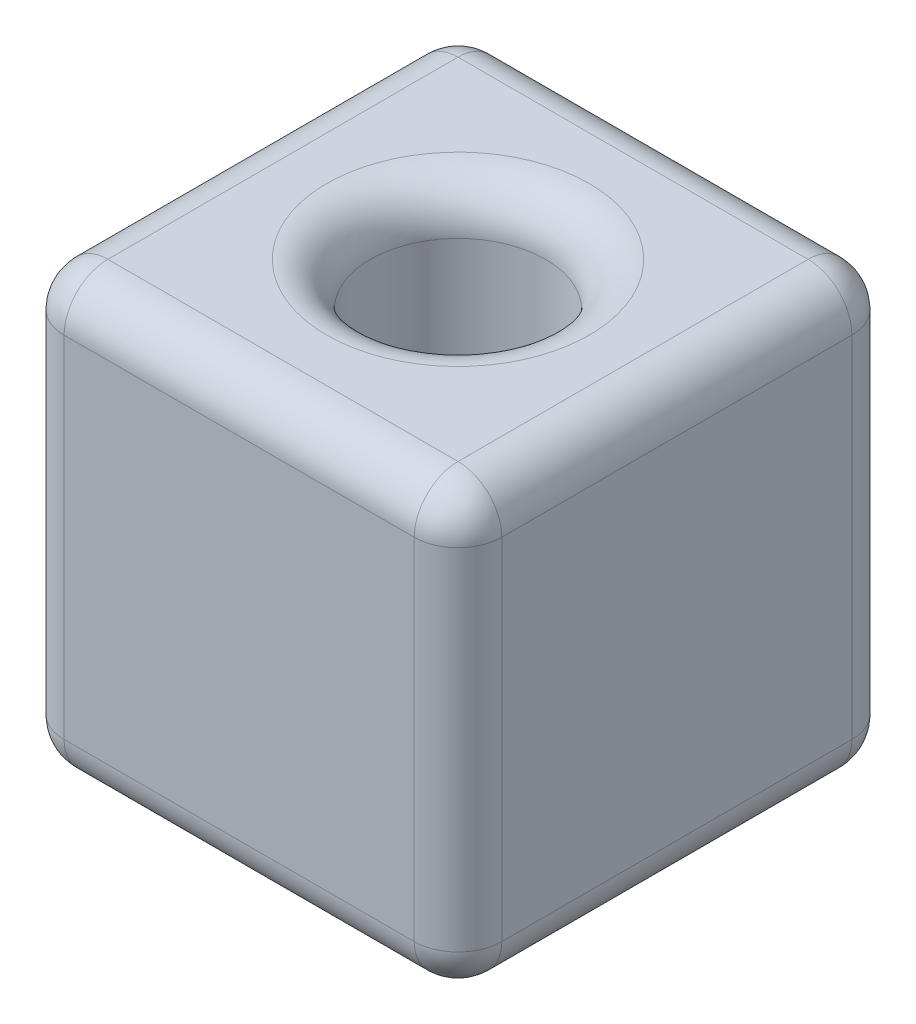
ISO-10303-21;
HEADER;
FILE_DESCRIPTION(('STEP AP214'),'2;1');
FILE_NAME('part.step','',(''),(''),'','','');
FILE_SCHEMA(('AUTOMOTIVE_DESIGN { 1 0 10303 214 1 1 1 1 }'));
ENDSEC;
DATA;
#1=APPLICATION_CONTEXT('core data for automotive mechanical design processes');
#2=APPLICATION_PROTOCOL_DEFINITION('international standard','automotive_design',2000,#1);
#3=PRODUCT_CONTEXT('',#1,'mechanical');
#4=PRODUCT('Part','Part','',(#3));
#5=PRODUCT_RELATED_PRODUCT_CATEGORY('part','',(#4));
#6=PRODUCT_DEFINITION_FORMATION('','',#4);
#7=PRODUCT_DEFINITION_CONTEXT('part definition',#1,'design');
#8=PRODUCT_DEFINITION('design','',#6,#7);
#9=PRODUCT_DEFINITION_SHAPE('','',#8);
#10=(LENGTH_UNIT() NAMED_UNIT(*) SI_UNIT(.MILLI.,.METRE.));
#11=(NAMED_UNIT(*) PLANE_ANGLE_UNIT() SI_UNIT($,.RADIAN.));
#12=(NAMED_UNIT(*) SI_UNIT($,.STERADIAN.) SOLID_ANGLE_UNIT());
#13=UNCERTAINTY_MEASURE_WITH_UNIT(LENGTH_MEASURE(1.E-05),#10,'distance_accuracy_value','');
#14=(GEOMETRIC_REPRESENTATION_CONTEXT(3) GLOBAL_UNCERTAINTY_ASSIGNED_CONTEXT((#13)) GLOBAL_UNIT_ASSIGNED_CONTEXT((#10,
#11,#12)) REPRESENTATION_CONTEXT('',''));
#15=CARTESIAN_POINT('',(0.,0.,0.));
#16=DIRECTION('',(0.,0.,1.));
#17=DIRECTION('',(1.,0.,0.));
#18=AXIS2_PLACEMENT_3D('',#15,#16,#17);
#19=CARTESIAN_POINT('',(2.5,2.5,-2.5));
#20=DIRECTION('',(-1.,0.,0.));
#21=DIRECTION('',(0.,0.,1.));
#22=AXIS2_PLACEMENT_3D('',#19,#20,#21);
#23=PLANE('',#22);
#24=DIRECTION('',(0.,0.,-1.));
#25=VECTOR('',#24,1.);
#26=CARTESIAN_POINT('',(2.5,-2.,-2.5));
#27=LINE('',#26,#25);
#28=CARTESIAN_POINT('',(2.5,-2.,2.));
#29=VERTEX_POINT('',#28);
#30=CARTESIAN_POINT('',(2.5,-2.,-2.));
#31=VERTEX_POINT('',#30);
#32=EDGE_CURVE('E138',#29,#31,#27,.T.);
#33=ORIENTED_EDGE('',*,*,#32,.T.);
#34=DIRECTION('',(0.,-1.,0.));
#35=VECTOR('',#34,1.);
#36=CARTESIAN_POINT('',(2.5,2.5,-2.));
#37=LINE('',#36,#35);
#38=CARTESIAN_POINT('',(2.5,2.,-2.));
#39=VERTEX_POINT('',#38);
#40=EDGE_CURVE('E195',#31,#39,#37,.F.);
#41=ORIENTED_EDGE('',*,*,#40,.T.);
#42=DIRECTION('',(0.,0.,-1.));
#43=VECTOR('',#42,1.);
#44=CARTESIAN_POINT('',(2.5,2.,2.5));
#45=LINE('',#44,#43);
#46=CARTESIAN_POINT('',(2.5,2.,2.));
#47=VERTEX_POINT('',#46);
#48=EDGE_CURVE('E190',#39,#47,#45,.F.);
#49=ORIENTED_EDGE('',*,*,#48,.T.);
#50=DIRECTION('',(0.,-1.,0.));
#51=VECTOR('',#50,1.);
#52=CARTESIAN_POINT('',(2.5,2.5,2.));
#53=LINE('',#52,#51);
#54=EDGE_CURVE('E192',#47,#29,#53,.T.);
#55=ORIENTED_EDGE('',*,*,#54,.T.);
#56=EDGE_LOOP('',(#33,#41,#49,#55));
#57=FACE_BOUND('',#56,.T.);
#58=ADVANCED_FACE('F33',(#57),#23,.F.);
#59=CARTESIAN_POINT('',(-2.5,2.5,-2.5));
#60=DIRECTION('',(0.,0.,1.));
#61=DIRECTION('',(1.,0.,0.));
#62=AXIS2_PLACEMENT_3D('',#59,#60,#61);
#63=PLANE('',#62);
#64=DIRECTION('',(-1.,0.,0.));
#65=VECTOR('',#64,1.);
#66=CARTESIAN_POINT('',(-2.5,-2.,-2.5));
#67=LINE('',#66,#65);
#68=CARTESIAN_POINT('',(2.,-2.,-2.5));
#69=VERTEX_POINT('',#68);
#70=CARTESIAN_POINT('',(-2.,-2.,-2.5));
#71=VERTEX_POINT('',#70);
#72=EDGE_CURVE('E185',#69,#71,#67,.T.);
#73=ORIENTED_EDGE('',*,*,#72,.T.);
#74=DIRECTION('',(0.,-1.,0.));
#75=VECTOR('',#74,1.);
#76=CARTESIAN_POINT('',(-2.,2.5,-2.5));
#77=LINE('',#76,#75);
#78=CARTESIAN_POINT('',(-2.,2.,-2.5));
#79=VERTEX_POINT('',#78);
#80=EDGE_CURVE('E187',#71,#79,#77,.F.);
#81=ORIENTED_EDGE('',*,*,#80,.T.);
#82=DIRECTION('',(-1.,0.,0.));
#83=VECTOR('',#82,1.);
#84=CARTESIAN_POINT('',(2.5,2.,-2.5));
#85=LINE('',#84,#83);
#86=CARTESIAN_POINT('',(2.,2.,-2.5));
#87=VERTEX_POINT('',#86);
#88=EDGE_CURVE('E181',#79,#87,#85,.F.);
#89=ORIENTED_EDGE('',*,*,#88,.T.);
#90=DIRECTION('',(0.,-1.,0.));
#91=VECTOR('',#90,1.);
#92=CARTESIAN_POINT('',(2.,2.5,-2.5));
#93=LINE('',#92,#91);
#94=EDGE_CURVE('E183',#87,#69,#93,.T.);
#95=ORIENTED_EDGE('',*,*,#94,.T.);
#96=EDGE_LOOP('',(#73,#81,#89,#95));
#97=FACE_BOUND('',#96,.T.);
#98=ADVANCED_FACE('F314',(#97),#63,.F.);
#99=CARTESIAN_POINT('',(-2.5,2.5,-2.5));
#100=DIRECTION('',(1.,0.,0.));
#101=DIRECTION('',(0.,0.,-1.));
#102=AXIS2_PLACEMENT_3D('',#99,#100,#101);
#103=PLANE('',#102);
#104=DIRECTION('',(0.,-1.,0.));
#105=VECTOR('',#104,1.);
#106=CARTESIAN_POINT('',(-2.5,2.5,-2.));
#107=LINE('',#106,#105);
#108=CARTESIAN_POINT('',(-2.5,2.,-2.));
#109=VERTEX_POINT('',#108);
#110=CARTESIAN_POINT('',(-2.5,-2.,-2.));
#111=VERTEX_POINT('',#110);
#112=EDGE_CURVE('E176',#109,#111,#107,.T.);
#113=ORIENTED_EDGE('',*,*,#112,.T.);
#114=DIRECTION('',(0.,0.,1.));
#115=VECTOR('',#114,1.);
#116=CARTESIAN_POINT('',(-2.5,-2.,-2.5));
#117=LINE('',#116,#115);
#118=CARTESIAN_POINT('',(-2.5,-2.,2.));
#119=VERTEX_POINT('',#118);
#120=EDGE_CURVE('E178',#111,#119,#117,.T.);
#121=ORIENTED_EDGE('',*,*,#120,.T.);
#122=DIRECTION('',(0.,-1.,0.));
#123=VECTOR('',#122,1.);
#124=CARTESIAN_POINT('',(-2.5,2.5,2.));
#125=LINE('',#124,#123);
#126=CARTESIAN_POINT('',(-2.5,2.,2.));
#127=VERTEX_POINT('',#126);
#128=EDGE_CURVE('E174',#119,#127,#125,.F.);
#129=ORIENTED_EDGE('',*,*,#128,.T.);
#130=DIRECTION('',(0.,0.,1.));
#131=VECTOR('',#130,1.);
#132=CARTESIAN_POINT('',(-2.5,2.,-2.5));
#133=LINE('',#132,#131);
#134=EDGE_CURVE('E172',#127,#109,#133,.F.);
#135=ORIENTED_EDGE('',*,*,#134,.T.);
#136=EDGE_LOOP('',(#113,#121,#129,#135));
#137=FACE_BOUND('',#136,.T.);
#138=ADVANCED_FACE('F341',(#137),#103,.F.);
#139=CARTESIAN_POINT('',(-2.5,2.5,2.5));
#140=DIRECTION('',(0.,0.,-1.));
#141=DIRECTION('',(-1.,0.,0.));
#142=AXIS2_PLACEMENT_3D('',#139,#140,#141);
#143=PLANE('',#142);
#144=DIRECTION('',(0.,-1.,0.));
#145=VECTOR('',#144,1.);
#146=CARTESIAN_POINT('',(-2.,2.5,2.5));
#147=LINE('',#146,#145);
#148=CARTESIAN_POINT('',(-2.,2.,2.5));
#149=VERTEX_POINT('',#148);
#150=CARTESIAN_POINT('',(-2.,-2.,2.5));
#151=VERTEX_POINT('',#150);
#152=EDGE_CURVE('E202',#149,#151,#147,.T.);
#153=ORIENTED_EDGE('',*,*,#152,.T.);
#154=DIRECTION('',(1.,0.,0.));
#155=VECTOR('',#154,1.);
#156=CARTESIAN_POINT('',(-2.5,-2.,2.5));
#157=LINE('',#156,#155);
#158=CARTESIAN_POINT('',(2.,-2.,2.5));
#159=VERTEX_POINT('',#158);
#160=EDGE_CURVE('E205',#151,#159,#157,.T.);
#161=ORIENTED_EDGE('',*,*,#160,.T.);
#162=DIRECTION('',(0.,-1.,0.));
#163=VECTOR('',#162,1.);
#164=CARTESIAN_POINT('',(2.,2.5,2.5));
#165=LINE('',#164,#163);
#166=CARTESIAN_POINT('',(2.,2.,2.5));
#167=VERTEX_POINT('',#166);
#168=EDGE_CURVE('E200',#159,#167,#165,.F.);
#169=ORIENTED_EDGE('',*,*,#168,.T.);
#170=DIRECTION('',(1.,0.,0.));
#171=VECTOR('',#170,1.);
#172=CARTESIAN_POINT('',(-2.5,2.,2.5));
#173=LINE('',#172,#171);
#174=EDGE_CURVE('E198',#167,#149,#173,.F.);
#175=ORIENTED_EDGE('',*,*,#174,.T.);
#176=EDGE_LOOP('',(#153,#161,#169,#175));
#177=FACE_BOUND('',#176,.T.);
#178=ADVANCED_FACE('F294',(#177),#143,.F.);
#179=CARTESIAN_POINT('',(0.,2.5,0.));
#180=DIRECTION('',(0.,1.,0.));
#181=DIRECTION('',(0.,0.,1.));
#182=AXIS2_PLACEMENT_3D('',#179,#180,#181);
#183=PLANE('',#182);
#184=DIRECTION('',(0.,0.,1.));
#185=VECTOR('',#184,1.);
#186=CARTESIAN_POINT('',(-2.,2.5,2.5));
#187=LINE('',#186,#185);
#188=CARTESIAN_POINT('',(-2.,2.5,-2.));
#189=VERTEX_POINT('',#188);
#190=CARTESIAN_POINT('',(-2.,2.5,2.));
#191=VERTEX_POINT('',#190);
#192=EDGE_CURVE('E42',#189,#191,#187,.T.);
#193=ORIENTED_EDGE('',*,*,#192,.T.);
#194=DIRECTION('',(1.,0.,0.));
#195=VECTOR('',#194,1.);
#196=CARTESIAN_POINT('',(2.5,2.5,2.));
#197=LINE('',#196,#195);
#198=CARTESIAN_POINT('',(2.,2.5,2.));
#199=VERTEX_POINT('',#198);
#200=EDGE_CURVE('E11',#191,#199,#197,.T.);
#201=ORIENTED_EDGE('',*,*,#200,.T.);
#202=DIRECTION('',(0.,0.,-1.));
#203=VECTOR('',#202,1.);
#204=CARTESIAN_POINT('',(2.,2.5,-2.5));
#205=LINE('',#204,#203);
#206=CARTESIAN_POINT('',(2.,2.5,-2.));
#207=VERTEX_POINT('',#206);
#208=EDGE_CURVE('E210',#199,#207,#205,.T.);
#209=ORIENTED_EDGE('',*,*,#208,.T.);
#210=DIRECTION('',(-1.,0.,0.));
#211=VECTOR('',#210,1.);
#212=CARTESIAN_POINT('',(-2.5,2.5,-2.));
#213=LINE('',#212,#211);
#214=EDGE_CURVE('E53',#207,#189,#213,.T.);
#215=ORIENTED_EDGE('',*,*,#214,.T.);
#216=EDGE_LOOP('',(#193,#201,#209,#215));
#217=FACE_BOUND('',#216,.T.);
#218=CARTESIAN_POINT('',(0.,2.5,0.));
#219=DIRECTION('',(0.,1.,0.));
#220=DIRECTION('',(0.,0.,1.));
#221=AXIS2_PLACEMENT_3D('',#218,#219,#220);
#222=CIRCLE('',#221,1.5);
#223=CARTESIAN_POINT('',(0.,2.5,1.5));
#224=VERTEX_POINT('',#223);
#225=EDGE_CURVE('E207',#224,#224,#222,.F.);
#226=ORIENTED_EDGE('',*,*,#225,.T.);
#227=EDGE_LOOP('',(#226));
#228=FACE_BOUND('',#227,.T.);
#229=ADVANCED_FACE('F274',(#217,#228),#183,.T.);
#230=CARTESIAN_POINT('',(0.,-2.5,0.));
#231=DIRECTION('',(0.,1.,0.));
#232=DIRECTION('',(0.,0.,1.));
#233=AXIS2_PLACEMENT_3D('',#230,#231,#232);
#234=PLANE('',#233);
#235=CARTESIAN_POINT('',(0.,-2.5,0.));
#236=DIRECTION('',(0.,1.,0.));
#237=DIRECTION('',(0.,0.,1.));
#238=AXIS2_PLACEMENT_3D('',#235,#236,#237);
#239=CIRCLE('',#238,1.5);
#240=CARTESIAN_POINT('',(0.,-2.5,1.5));
#241=VERTEX_POINT('',#240);
#242=EDGE_CURVE('E163',#241,#241,#239,.T.);
#243=ORIENTED_EDGE('',*,*,#242,.T.);
#244=EDGE_LOOP('',(#243));
#245=FACE_BOUND('',#244,.T.);
#246=DIRECTION('',(1.,0.,0.));
#247=VECTOR('',#246,1.);
#248=CARTESIAN_POINT('',(0.,-2.5,2.));
#249=LINE('',#248,#247);
#250=CARTESIAN_POINT('',(2.,-2.5,2.));
#251=VERTEX_POINT('',#250);
#252=CARTESIAN_POINT('',(-2.,-2.5,2.));
#253=VERTEX_POINT('',#252);
#254=EDGE_CURVE('E125',#251,#253,#249,.F.);
#255=ORIENTED_EDGE('',*,*,#254,.T.);
#256=DIRECTION('',(0.,0.,1.));
#257=VECTOR('',#256,1.);
#258=CARTESIAN_POINT('',(-2.,-2.5,0.));
#259=LINE('',#258,#257);
#260=CARTESIAN_POINT('',(-2.,-2.5,-2.));
#261=VERTEX_POINT('',#260);
#262=EDGE_CURVE('E161',#253,#261,#259,.F.);
#263=ORIENTED_EDGE('',*,*,#262,.T.);
#264=DIRECTION('',(-1.,0.,0.));
#265=VECTOR('',#264,1.);
#266=CARTESIAN_POINT('',(0.,-2.5,-2.));
#267=LINE('',#266,#265);
#268=CARTESIAN_POINT('',(2.,-2.5,-2.));
#269=VERTEX_POINT('',#268);
#270=EDGE_CURVE('E128',#261,#269,#267,.F.);
#271=ORIENTED_EDGE('',*,*,#270,.T.);
#272=DIRECTION('',(0.,0.,-1.));
#273=VECTOR('',#272,1.);
#274=CARTESIAN_POINT('',(2.,-2.5,0.));
#275=LINE('',#274,#273);
#276=EDGE_CURVE('E120',#269,#251,#275,.F.);
#277=ORIENTED_EDGE('',*,*,#276,.T.);
#278=EDGE_LOOP('',(#255,#263,#271,#277));
#279=FACE_BOUND('',#278,.T.);
#280=ADVANCED_FACE('F122',(#245,#279),#234,.F.);
#281=CARTESIAN_POINT('',(0.,-2.5,0.));
#282=DIRECTION('',(0.,1.,0.));
#283=DIRECTION('',(0.,0.,1.));
#284=AXIS2_PLACEMENT_3D('',#281,#282,#283);
#285=CYLINDRICAL_SURFACE('',#284,1.);
#286=CARTESIAN_POINT('',(0.,-2.,0.));
#287=DIRECTION('',(0.,1.,0.));
#288=DIRECTION('',(0.,0.,1.));
#289=AXIS2_PLACEMENT_3D('',#286,#287,#288);
#290=CIRCLE('',#289,1.);
#291=CARTESIAN_POINT('',(0.,-2.,1.));
#292=VERTEX_POINT('',#291);
#293=EDGE_CURVE('E169',#292,#292,#290,.F.);
#294=ORIENTED_EDGE('',*,*,#293,.T.);
#295=EDGE_LOOP('',(#294));
#296=FACE_BOUND('',#295,.T.);
#297=CARTESIAN_POINT('',(0.,2.,0.));
#298=DIRECTION('',(0.,1.,0.));
#299=DIRECTION('',(0.,0.,1.));
#300=AXIS2_PLACEMENT_3D('',#297,#298,#299);
#301=CIRCLE('',#300,1.);
#302=CARTESIAN_POINT('',(0.,2.,1.));
#303=VERTEX_POINT('',#302);
#304=EDGE_CURVE('E166',#303,#303,#301,.T.);
#305=ORIENTED_EDGE('',*,*,#304,.T.);
#306=EDGE_LOOP('',(#305));
#307=FACE_BOUND('',#306,.T.);
#308=ADVANCED_FACE('F347',(#296,#307),#285,.F.);
#309=CARTESIAN_POINT('',(0.,-2.,0.));
#310=DIRECTION('',(0.,1.,0.));
#311=DIRECTION('',(0.,0.,1.));
#312=AXIS2_PLACEMENT_3D('',#309,#310,#311);
#313=TOROIDAL_SURFACE('',#312,1.5,0.5);
#314=ORIENTED_EDGE('',*,*,#293,.F.);
#315=EDGE_LOOP('',(#314));
#316=FACE_BOUND('',#315,.T.);
#317=ORIENTED_EDGE('',*,*,#242,.F.);
#318=EDGE_LOOP('',(#317));
#319=FACE_BOUND('',#318,.T.);
#320=ADVANCED_FACE('F335',(#316,#319),#313,.T.);
#321=CARTESIAN_POINT('',(2.,2.,0.));
#322=DIRECTION('',(0.,0.,1.));
#323=DIRECTION('',(1.,0.,0.));
#324=AXIS2_PLACEMENT_3D('',#321,#322,#323);
#325=CYLINDRICAL_SURFACE('',#324,0.5);
#326=CARTESIAN_POINT('',(2.,2.,-2.));
#327=DIRECTION('',(0.,0.,-1.));
#328=DIRECTION('',(-1.,0.,0.));
#329=AXIS2_PLACEMENT_3D('',#326,#327,#328);
#330=CIRCLE('',#329,0.5);
#331=EDGE_CURVE('E37',#207,#39,#330,.T.);
#332=ORIENTED_EDGE('',*,*,#331,.F.);
#333=ORIENTED_EDGE('',*,*,#208,.F.);
#334=CARTESIAN_POINT('',(2.,2.,2.));
#335=DIRECTION('',(0.,0.,1.));
#336=DIRECTION('',(0.,-1.,0.));
#337=AXIS2_PLACEMENT_3D('',#334,#335,#336);
#338=CIRCLE('',#337,0.5);
#339=EDGE_CURVE('E158',#47,#199,#338,.T.);
#340=ORIENTED_EDGE('',*,*,#339,.F.);
#341=ORIENTED_EDGE('',*,*,#48,.F.);
#342=EDGE_LOOP('',(#332,#333,#340,#341));
#343=FACE_BOUND('',#342,.T.);
#344=ADVANCED_FACE('F272',(#343),#325,.T.);
#345=CARTESIAN_POINT('',(2.,2.,-2.));
#346=DIRECTION('',(0.,0.,1.));
#347=DIRECTION('',(1.,0.,0.));
#348=AXIS2_PLACEMENT_3D('',#345,#346,#347);
#349=SPHERICAL_SURFACE('',#348,0.5);
#350=CARTESIAN_POINT('',(2.,2.,-2.));
#351=DIRECTION('',(1.,0.,0.));
#352=DIRECTION('',(0.,1.,0.));
#353=AXIS2_PLACEMENT_3D('',#350,#351,#352);
#354=CIRCLE('',#353,0.5);
#355=EDGE_CURVE('E256',#207,#87,#354,.F.);
#356=ORIENTED_EDGE('',*,*,#355,.F.);
#357=ORIENTED_EDGE('',*,*,#331,.T.);
#358=CARTESIAN_POINT('',(2.,2.,-2.));
#359=DIRECTION('',(0.,1.,0.));
#360=DIRECTION('',(0.,0.,1.));
#361=AXIS2_PLACEMENT_3D('',#358,#359,#360);
#362=CIRCLE('',#361,0.5);
#363=EDGE_CURVE('E259',#87,#39,#362,.F.);
#364=ORIENTED_EDGE('',*,*,#363,.F.);
#365=EDGE_LOOP('',(#356,#357,#364));
#366=FACE_BOUND('',#365,.T.);
#367=ADVANCED_FACE('F327',(#366),#349,.T.);
#368=CARTESIAN_POINT('',(2.,2.,2.));
#369=DIRECTION('',(0.,0.,1.));
#370=DIRECTION('',(1.,0.,0.));
#371=AXIS2_PLACEMENT_3D('',#368,#369,#370);
#372=SPHERICAL_SURFACE('',#371,0.5);
#373=CARTESIAN_POINT('',(2.,2.,2.));
#374=DIRECTION('',(0.,1.,0.));
#375=DIRECTION('',(0.,0.,1.));
#376=AXIS2_PLACEMENT_3D('',#373,#374,#375);
#377=CIRCLE('',#376,0.5);
#378=EDGE_CURVE('E251',#47,#167,#377,.F.);
#379=ORIENTED_EDGE('',*,*,#378,.F.);
#380=ORIENTED_EDGE('',*,*,#339,.T.);
#381=CARTESIAN_POINT('',(2.,2.,2.));
#382=DIRECTION('',(1.,0.,0.));
#383=DIRECTION('',(0.,0.,-1.));
#384=AXIS2_PLACEMENT_3D('',#381,#382,#383);
#385=CIRCLE('',#384,0.5);
#386=EDGE_CURVE('E254',#167,#199,#385,.F.);
#387=ORIENTED_EDGE('',*,*,#386,.F.);
#388=EDGE_LOOP('',(#379,#380,#387));
#389=FACE_BOUND('',#388,.T.);
#390=ADVANCED_FACE('F266',(#389),#372,.T.);
#391=CARTESIAN_POINT('',(2.,2.5,-2.));
#392=DIRECTION('',(0.,-1.,0.));
#393=DIRECTION('',(0.,0.,-1.));
#394=AXIS2_PLACEMENT_3D('',#391,#392,#393);
#395=CYLINDRICAL_SURFACE('',#394,0.5);
#396=ORIENTED_EDGE('',*,*,#363,.T.);
#397=ORIENTED_EDGE('',*,*,#40,.F.);
#398=CARTESIAN_POINT('',(2.,-2.,-2.));
#399=DIRECTION('',(0.,-1.,0.));
#400=DIRECTION('',(0.,0.,-1.));
#401=AXIS2_PLACEMENT_3D('',#398,#399,#400);
#402=CIRCLE('',#401,0.5);
#403=EDGE_CURVE('E246',#69,#31,#402,.T.);
#404=ORIENTED_EDGE('',*,*,#403,.F.);
#405=ORIENTED_EDGE('',*,*,#94,.F.);
#406=EDGE_LOOP('',(#396,#397,#404,#405));
#407=FACE_BOUND('',#406,.T.);
#408=ADVANCED_FACE('F302',(#407),#395,.T.);
#409=CARTESIAN_POINT('',(0.,2.,-2.));
#410=DIRECTION('',(1.,0.,0.));
#411=DIRECTION('',(0.,0.,-1.));
#412=AXIS2_PLACEMENT_3D('',#409,#410,#411);
#413=CYLINDRICAL_SURFACE('',#412,0.5);
#414=ORIENTED_EDGE('',*,*,#355,.T.);
#415=ORIENTED_EDGE('',*,*,#88,.F.);
#416=CARTESIAN_POINT('',(-2.,2.,-2.));
#417=DIRECTION('',(-1.,0.,0.));
#418=DIRECTION('',(0.,0.,1.));
#419=AXIS2_PLACEMENT_3D('',#416,#417,#418);
#420=CIRCLE('',#419,0.5);
#421=EDGE_CURVE('E243',#189,#79,#420,.T.);
#422=ORIENTED_EDGE('',*,*,#421,.F.);
#423=ORIENTED_EDGE('',*,*,#214,.F.);
#424=EDGE_LOOP('',(#414,#415,#422,#423));
#425=FACE_BOUND('',#424,.T.);
#426=ADVANCED_FACE('F325',(#425),#413,.T.);
#427=CARTESIAN_POINT('',(-2.,2.,0.));
#428=DIRECTION('',(0.,0.,-1.));
#429=DIRECTION('',(-1.,0.,0.));
#430=AXIS2_PLACEMENT_3D('',#427,#428,#429);
#431=CYLINDRICAL_SURFACE('',#430,0.5);
#432=CARTESIAN_POINT('',(-2.,2.,2.));
#433=DIRECTION('',(0.,0.,1.));
#434=DIRECTION('',(1.,0.,0.));
#435=AXIS2_PLACEMENT_3D('',#432,#433,#434);
#436=CIRCLE('',#435,0.5);
#437=EDGE_CURVE('E237',#191,#127,#436,.T.);
#438=ORIENTED_EDGE('',*,*,#437,.F.);
#439=ORIENTED_EDGE('',*,*,#192,.F.);
#440=CARTESIAN_POINT('',(-2.,2.,-2.));
#441=DIRECTION('',(0.,0.,-1.));
#442=DIRECTION('',(-1.,0.,0.));
#443=AXIS2_PLACEMENT_3D('',#440,#441,#442);
#444=CIRCLE('',#443,0.5);
#445=EDGE_CURVE('E240',#109,#189,#444,.T.);
#446=ORIENTED_EDGE('',*,*,#445,.F.);
#447=ORIENTED_EDGE('',*,*,#134,.F.);
#448=EDGE_LOOP('',(#438,#439,#446,#447));
#449=FACE_BOUND('',#448,.T.);
#450=ADVANCED_FACE('F283',(#449),#431,.T.);
#451=CARTESIAN_POINT('',(0.,2.,2.));
#452=DIRECTION('',(-1.,0.,0.));
#453=DIRECTION('',(0.,0.,1.));
#454=AXIS2_PLACEMENT_3D('',#451,#452,#453);
#455=CYLINDRICAL_SURFACE('',#454,0.5);
#456=ORIENTED_EDGE('',*,*,#386,.T.);
#457=ORIENTED_EDGE('',*,*,#200,.F.);
#458=CARTESIAN_POINT('',(-2.,2.,2.));
#459=DIRECTION('',(-1.,0.,0.));
#460=DIRECTION('',(0.,0.,1.));
#461=AXIS2_PLACEMENT_3D('',#458,#459,#460);
#462=CIRCLE('',#461,0.5);
#463=EDGE_CURVE('E234',#149,#191,#462,.T.);
#464=ORIENTED_EDGE('',*,*,#463,.F.);
#465=ORIENTED_EDGE('',*,*,#174,.F.);
#466=EDGE_LOOP('',(#456,#457,#464,#465));
#467=FACE_BOUND('',#466,.T.);
#468=ADVANCED_FACE('F279',(#467),#455,.T.);
#469=CARTESIAN_POINT('',(2.,2.5,2.));
#470=DIRECTION('',(0.,-1.,0.));
#471=DIRECTION('',(0.,0.,-1.));
#472=AXIS2_PLACEMENT_3D('',#469,#470,#471);
#473=CYLINDRICAL_SURFACE('',#472,0.5);
#474=ORIENTED_EDGE('',*,*,#378,.T.);
#475=ORIENTED_EDGE('',*,*,#168,.F.);
#476=CARTESIAN_POINT('',(2.,-2.,2.));
#477=DIRECTION('',(0.,-1.,0.));
#478=DIRECTION('',(0.,0.,-1.));
#479=AXIS2_PLACEMENT_3D('',#476,#477,#478);
#480=CIRCLE('',#479,0.5);
#481=EDGE_CURVE('E142',#29,#159,#480,.T.);
#482=ORIENTED_EDGE('',*,*,#481,.F.);
#483=ORIENTED_EDGE('',*,*,#54,.F.);
#484=EDGE_LOOP('',(#474,#475,#482,#483));
#485=FACE_BOUND('',#484,.T.);
#486=ADVANCED_FACE('F297',(#485),#473,.T.);
#487=CARTESIAN_POINT('',(2.,-2.,-2.5));
#488=DIRECTION('',(0.,0.,-1.));
#489=DIRECTION('',(-1.,0.,0.));
#490=AXIS2_PLACEMENT_3D('',#487,#488,#489);
#491=CYLINDRICAL_SURFACE('',#490,0.5);
#492=CARTESIAN_POINT('',(2.,-2.,-2.));
#493=DIRECTION('',(0.,0.,-1.));
#494=DIRECTION('',(-1.,0.,0.));
#495=AXIS2_PLACEMENT_3D('',#492,#493,#494);
#496=CIRCLE('',#495,0.5);
#497=EDGE_CURVE('E249',#31,#269,#496,.T.);
#498=ORIENTED_EDGE('',*,*,#497,.F.);
#499=ORIENTED_EDGE('',*,*,#32,.F.);
#500=CARTESIAN_POINT('',(2.,-2.,2.));
#501=DIRECTION('',(0.,0.,1.));
#502=DIRECTION('',(1.,0.,0.));
#503=AXIS2_PLACEMENT_3D('',#500,#501,#502);
#504=CIRCLE('',#503,0.5);
#505=EDGE_CURVE('E135',#251,#29,#504,.T.);
#506=ORIENTED_EDGE('',*,*,#505,.F.);
#507=ORIENTED_EDGE('',*,*,#276,.F.);
#508=EDGE_LOOP('',(#498,#499,#506,#507));
#509=FACE_BOUND('',#508,.T.);
#510=ADVANCED_FACE('F137',(#509),#491,.T.);
#511=CARTESIAN_POINT('',(2.,-2.,-2.));
#512=DIRECTION('',(0.,0.,1.));
#513=DIRECTION('',(1.,0.,0.));
#514=AXIS2_PLACEMENT_3D('',#511,#512,#513);
#515=SPHERICAL_SURFACE('',#514,0.5);
#516=ORIENTED_EDGE('',*,*,#403,.T.);
#517=ORIENTED_EDGE('',*,*,#497,.T.);
#518=CARTESIAN_POINT('',(2.,-2.,-2.));
#519=DIRECTION('',(1.,0.,0.));
#520=DIRECTION('',(0.,0.,-1.));
#521=AXIS2_PLACEMENT_3D('',#518,#519,#520);
#522=CIRCLE('',#521,0.5);
#523=EDGE_CURVE('E143',#69,#269,#522,.F.);
#524=ORIENTED_EDGE('',*,*,#523,.F.);
#525=EDGE_LOOP('',(#516,#517,#524));
#526=FACE_BOUND('',#525,.T.);
#527=ADVANCED_FACE('F307',(#526),#515,.T.);
#528=CARTESIAN_POINT('',(-2.,2.,-2.));
#529=DIRECTION('',(0.,0.,1.));
#530=DIRECTION('',(1.,0.,0.));
#531=AXIS2_PLACEMENT_3D('',#528,#529,#530);
#532=SPHERICAL_SURFACE('',#531,0.5);
#533=ORIENTED_EDGE('',*,*,#445,.T.);
#534=ORIENTED_EDGE('',*,*,#421,.T.);
#535=CARTESIAN_POINT('',(-2.,2.,-2.));
#536=DIRECTION('',(0.,1.,0.));
#537=DIRECTION('',(0.,0.,1.));
#538=AXIS2_PLACEMENT_3D('',#535,#536,#537);
#539=CIRCLE('',#538,0.5);
#540=EDGE_CURVE('E229',#109,#79,#539,.F.);
#541=ORIENTED_EDGE('',*,*,#540,.F.);
#542=EDGE_LOOP('',(#533,#534,#541));
#543=FACE_BOUND('',#542,.T.);
#544=ADVANCED_FACE('F323',(#543),#532,.T.);
#545=CARTESIAN_POINT('',(-2.,2.,2.));
#546=DIRECTION('',(0.,0.,1.));
#547=DIRECTION('',(1.,0.,0.));
#548=AXIS2_PLACEMENT_3D('',#545,#546,#547);
#549=SPHERICAL_SURFACE('',#548,0.5);
#550=ORIENTED_EDGE('',*,*,#463,.T.);
#551=ORIENTED_EDGE('',*,*,#437,.T.);
#552=CARTESIAN_POINT('',(-2.,2.,2.));
#553=DIRECTION('',(0.,1.,0.));
#554=DIRECTION('',(0.,0.,1.));
#555=AXIS2_PLACEMENT_3D('',#552,#553,#554);
#556=CIRCLE('',#555,0.5);
#557=EDGE_CURVE('E150',#149,#127,#556,.F.);
#558=ORIENTED_EDGE('',*,*,#557,.F.);
#559=EDGE_LOOP('',(#550,#551,#558));
#560=FACE_BOUND('',#559,.T.);
#561=ADVANCED_FACE('F287',(#560),#549,.T.);
#562=CARTESIAN_POINT('',(2.,-2.,2.));
#563=DIRECTION('',(0.,0.,1.));
#564=DIRECTION('',(1.,0.,0.));
#565=AXIS2_PLACEMENT_3D('',#562,#563,#564);
#566=SPHERICAL_SURFACE('',#565,0.5);
#567=ORIENTED_EDGE('',*,*,#505,.T.);
#568=ORIENTED_EDGE('',*,*,#481,.T.);
#569=CARTESIAN_POINT('',(2.,-2.,2.));
#570=DIRECTION('',(1.,0.,0.));
#571=DIRECTION('',(0.,0.,-1.));
#572=AXIS2_PLACEMENT_3D('',#569,#570,#571);
#573=CIRCLE('',#572,0.5);
#574=EDGE_CURVE('E146',#251,#159,#573,.F.);
#575=ORIENTED_EDGE('',*,*,#574,.F.);
#576=EDGE_LOOP('',(#567,#568,#575));
#577=FACE_BOUND('',#576,.T.);
#578=ADVANCED_FACE('F147',(#577),#566,.T.);
#579=CARTESIAN_POINT('',(-2.5,-2.,-2.));
#580=DIRECTION('',(-1.,0.,0.));
#581=DIRECTION('',(0.,0.,1.));
#582=AXIS2_PLACEMENT_3D('',#579,#580,#581);
#583=CYLINDRICAL_SURFACE('',#582,0.5);
#584=ORIENTED_EDGE('',*,*,#523,.T.);
#585=ORIENTED_EDGE('',*,*,#270,.F.);
#586=CARTESIAN_POINT('',(-2.,-2.,-2.));
#587=DIRECTION('',(-1.,0.,0.));
#588=DIRECTION('',(0.,0.,1.));
#589=AXIS2_PLACEMENT_3D('',#586,#587,#588);
#590=CIRCLE('',#589,0.5);
#591=EDGE_CURVE('E151',#71,#261,#590,.T.);
#592=ORIENTED_EDGE('',*,*,#591,.F.);
#593=ORIENTED_EDGE('',*,*,#72,.F.);
#594=EDGE_LOOP('',(#584,#585,#592,#593));
#595=FACE_BOUND('',#594,.T.);
#596=ADVANCED_FACE('F311',(#595),#583,.T.);
#597=CARTESIAN_POINT('',(-2.,2.5,-2.));
#598=DIRECTION('',(0.,-1.,0.));
#599=DIRECTION('',(0.,0.,-1.));
#600=AXIS2_PLACEMENT_3D('',#597,#598,#599);
#601=CYLINDRICAL_SURFACE('',#600,0.5);
#602=ORIENTED_EDGE('',*,*,#540,.T.);
#603=ORIENTED_EDGE('',*,*,#80,.F.);
#604=CARTESIAN_POINT('',(-2.,-2.,-2.));
#605=DIRECTION('',(0.,-1.,0.));
#606=DIRECTION('',(0.,0.,-1.));
#607=AXIS2_PLACEMENT_3D('',#604,#605,#606);
#608=CIRCLE('',#607,0.5);
#609=EDGE_CURVE('E222',#111,#71,#608,.T.);
#610=ORIENTED_EDGE('',*,*,#609,.F.);
#611=ORIENTED_EDGE('',*,*,#112,.F.);
#612=EDGE_LOOP('',(#602,#603,#610,#611));
#613=FACE_BOUND('',#612,.T.);
#614=ADVANCED_FACE('F317',(#613),#601,.T.);
#615=CARTESIAN_POINT('',(-2.,2.5,2.));
#616=DIRECTION('',(0.,-1.,0.));
#617=DIRECTION('',(0.,0.,-1.));
#618=AXIS2_PLACEMENT_3D('',#615,#616,#617);
#619=CYLINDRICAL_SURFACE('',#618,0.5);
#620=ORIENTED_EDGE('',*,*,#557,.T.);
#621=ORIENTED_EDGE('',*,*,#128,.F.);
#622=CARTESIAN_POINT('',(-2.,-2.,2.));
#623=DIRECTION('',(0.,-1.,0.));
#624=DIRECTION('',(0.,0.,-1.));
#625=AXIS2_PLACEMENT_3D('',#622,#623,#624);
#626=CIRCLE('',#625,0.5);
#627=EDGE_CURVE('E219',#151,#119,#626,.T.);
#628=ORIENTED_EDGE('',*,*,#627,.F.);
#629=ORIENTED_EDGE('',*,*,#152,.F.);
#630=EDGE_LOOP('',(#620,#621,#628,#629));
#631=FACE_BOUND('',#630,.T.);
#632=ADVANCED_FACE('F292',(#631),#619,.T.);
#633=CARTESIAN_POINT('',(-2.5,-2.,2.));
#634=DIRECTION('',(1.,0.,0.));
#635=DIRECTION('',(0.,0.,-1.));
#636=AXIS2_PLACEMENT_3D('',#633,#634,#635);
#637=CYLINDRICAL_SURFACE('',#636,0.5);
#638=ORIENTED_EDGE('',*,*,#574,.T.);
#639=ORIENTED_EDGE('',*,*,#160,.F.);
#640=CARTESIAN_POINT('',(-2.,-2.,2.));
#641=DIRECTION('',(-1.,0.,0.));
#642=DIRECTION('',(0.,0.,1.));
#643=AXIS2_PLACEMENT_3D('',#640,#641,#642);
#644=CIRCLE('',#643,0.5);
#645=EDGE_CURVE('E154',#253,#151,#644,.T.);
#646=ORIENTED_EDGE('',*,*,#645,.F.);
#647=ORIENTED_EDGE('',*,*,#254,.F.);
#648=EDGE_LOOP('',(#638,#639,#646,#647));
#649=FACE_BOUND('',#648,.T.);
#650=ADVANCED_FACE('F153',(#649),#637,.T.);
#651=CARTESIAN_POINT('',(-2.,-2.,-2.));
#652=DIRECTION('',(0.,0.,1.));
#653=DIRECTION('',(1.,0.,0.));
#654=AXIS2_PLACEMENT_3D('',#651,#652,#653);
#655=SPHERICAL_SURFACE('',#654,0.5);
#656=ORIENTED_EDGE('',*,*,#609,.T.);
#657=ORIENTED_EDGE('',*,*,#591,.T.);
#658=CARTESIAN_POINT('',(-2.,-2.,-2.));
#659=DIRECTION('',(0.,0.,-1.));
#660=DIRECTION('',(-1.,0.,0.));
#661=AXIS2_PLACEMENT_3D('',#658,#659,#660);
#662=CIRCLE('',#661,0.5);
#663=EDGE_CURVE('E216',#111,#261,#662,.F.);
#664=ORIENTED_EDGE('',*,*,#663,.F.);
#665=EDGE_LOOP('',(#656,#657,#664));
#666=FACE_BOUND('',#665,.T.);
#667=ADVANCED_FACE('F356',(#666),#655,.T.);
#668=CARTESIAN_POINT('',(-2.,-2.,2.));
#669=DIRECTION('',(0.,0.,1.));
#670=DIRECTION('',(1.,0.,0.));
#671=AXIS2_PLACEMENT_3D('',#668,#669,#670);
#672=SPHERICAL_SURFACE('',#671,0.5);
#673=ORIENTED_EDGE('',*,*,#645,.T.);
#674=ORIENTED_EDGE('',*,*,#627,.T.);
#675=CARTESIAN_POINT('',(-2.,-2.,2.));
#676=DIRECTION('',(0.,0.,1.));
#677=DIRECTION('',(1.,0.,0.));
#678=AXIS2_PLACEMENT_3D('',#675,#676,#677);
#679=CIRCLE('',#678,0.5);
#680=EDGE_CURVE('E214',#253,#119,#679,.F.);
#681=ORIENTED_EDGE('',*,*,#680,.F.);
#682=EDGE_LOOP('',(#673,#674,#681));
#683=FACE_BOUND('',#682,.T.);
#684=ADVANCED_FACE('F352',(#683),#672,.T.);
#685=CARTESIAN_POINT('',(-2.,-2.,-2.5));
#686=DIRECTION('',(0.,0.,1.));
#687=DIRECTION('',(1.,0.,0.));
#688=AXIS2_PLACEMENT_3D('',#685,#686,#687);
#689=CYLINDRICAL_SURFACE('',#688,0.5);
#690=ORIENTED_EDGE('',*,*,#663,.T.);
#691=ORIENTED_EDGE('',*,*,#262,.F.);
#692=ORIENTED_EDGE('',*,*,#680,.T.);
#693=ORIENTED_EDGE('',*,*,#120,.F.);
#694=EDGE_LOOP('',(#690,#691,#692,#693));
#695=FACE_BOUND('',#694,.T.);
#696=ADVANCED_FACE('F349',(#695),#689,.T.);
#697=CARTESIAN_POINT('',(0.,2.,0.));
#698=DIRECTION('',(0.,1.,0.));
#699=DIRECTION('',(0.,0.,1.));
#700=AXIS2_PLACEMENT_3D('',#697,#698,#699);
#701=TOROIDAL_SURFACE('',#700,1.5,0.5);
#702=ORIENTED_EDGE('',*,*,#225,.F.);
#703=EDGE_LOOP('',(#702));
#704=FACE_BOUND('',#703,.T.);
#705=ORIENTED_EDGE('',*,*,#304,.F.);
#706=EDGE_LOOP('',(#705));
#707=FACE_BOUND('',#706,.T.);
#708=ADVANCED_FACE('F35',(#704,#707),#701,.T.);
#709=CLOSED_SHELL('',(#58,#98,#138,#178,#229,#280,#308,#320,#344,#367,#390,#408,#426,#450,#468,
#486,#510,#527,#544,#561,#578,#596,#614,#632,#650,#667,#684,#696,#708));
#710=MANIFOLD_SOLID_BREP('B2',#709);
#711=ADVANCED_BREP_SHAPE_REPRESENTATION('',(#18,#710),#14);
#712=SHAPE_DEFINITION_REPRESENTATION(#9,#711);
ENDSEC;
END-ISO-10303-21;
